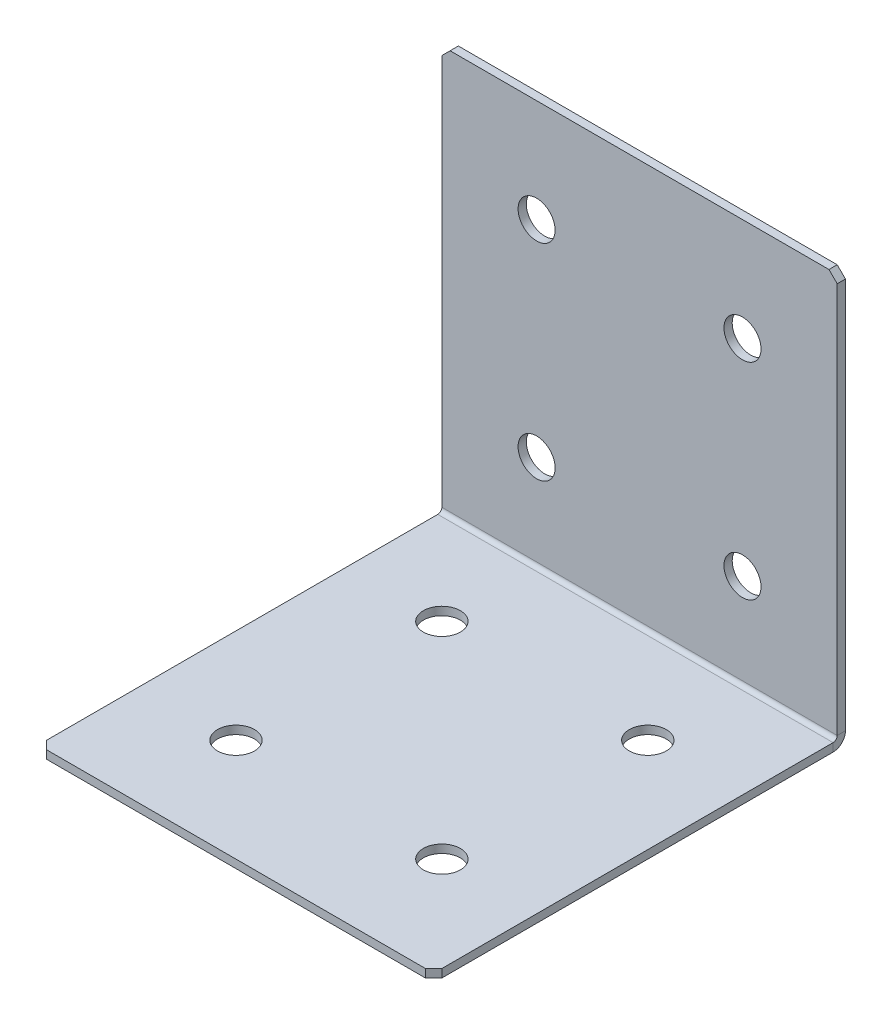
ISO-10303-21;
HEADER;
FILE_DESCRIPTION(('STEP AP214'),'2;1');
FILE_NAME('part.step','',(''),(''),'','','');
FILE_SCHEMA(('AUTOMOTIVE_DESIGN { 1 0 10303 214 1 1 1 1 }'));
ENDSEC;
DATA;
#1=APPLICATION_CONTEXT('core data for automotive mechanical design processes');
#2=APPLICATION_PROTOCOL_DEFINITION('international standard','automotive_design',2000,#1);
#3=PRODUCT_CONTEXT('',#1,'mechanical');
#4=PRODUCT('Part','Part','',(#3));
#5=PRODUCT_RELATED_PRODUCT_CATEGORY('part','',(#4));
#6=PRODUCT_DEFINITION_FORMATION('','',#4);
#7=PRODUCT_DEFINITION_CONTEXT('part definition',#1,'design');
#8=PRODUCT_DEFINITION('design','',#6,#7);
#9=PRODUCT_DEFINITION_SHAPE('','',#8);
#10=(LENGTH_UNIT() NAMED_UNIT(*) SI_UNIT(.MILLI.,.METRE.));
#11=(NAMED_UNIT(*) PLANE_ANGLE_UNIT() SI_UNIT($,.RADIAN.));
#12=(NAMED_UNIT(*) SI_UNIT($,.STERADIAN.) SOLID_ANGLE_UNIT());
#13=UNCERTAINTY_MEASURE_WITH_UNIT(LENGTH_MEASURE(1.E-05),#10,'distance_accuracy_value','');
#14=(GEOMETRIC_REPRESENTATION_CONTEXT(3) GLOBAL_UNCERTAINTY_ASSIGNED_CONTEXT((#13)) GLOBAL_UNIT_ASSIGNED_CONTEXT((#10,
#11,#12)) REPRESENTATION_CONTEXT('',''));
#15=CARTESIAN_POINT('',(0.,0.,0.));
#16=DIRECTION('',(0.,0.,1.));
#17=DIRECTION('',(1.,0.,0.));
#18=AXIS2_PLACEMENT_3D('',#15,#16,#17);
#19=CARTESIAN_POINT('',(0.,0.,2.));
#20=DIRECTION('',(0.,0.,-1.));
#21=DIRECTION('',(-1.,0.,0.));
#22=AXIS2_PLACEMENT_3D('',#19,#20,#21);
#23=PLANE('',#22);
#24=CARTESIAN_POINT('',(25.,24.9999999999996,2.));
#25=DIRECTION('',(0.,0.,1.));
#26=DIRECTION('',(1.,0.,0.));
#27=AXIS2_PLACEMENT_3D('',#24,#25,#26);
#28=CIRCLE('',#27,4.5);
#29=CARTESIAN_POINT('',(29.5,24.9999999999996,2.));
#30=VERTEX_POINT('',#29);
#31=EDGE_CURVE('E747',#30,#30,#28,.T.);
#32=ORIENTED_EDGE('',*,*,#31,.F.);
#33=EDGE_LOOP('',(#32));
#34=FACE_BOUND('',#33,.T.);
#35=CARTESIAN_POINT('',(25.,74.9999999999996,2.));
#36=DIRECTION('',(0.,0.,1.));
#37=DIRECTION('',(1.,0.,0.));
#38=AXIS2_PLACEMENT_3D('',#35,#36,#37);
#39=CIRCLE('',#38,4.5);
#40=CARTESIAN_POINT('',(29.5,74.9999999999996,2.));
#41=VERTEX_POINT('',#40);
#42=EDGE_CURVE('E763',#41,#41,#39,.T.);
#43=ORIENTED_EDGE('',*,*,#42,.F.);
#44=EDGE_LOOP('',(#43));
#45=FACE_BOUND('',#44,.T.);
#46=DIRECTION('',(0.,1.,0.));
#47=VECTOR('',#46,1.);
#48=CARTESIAN_POINT('',(48.,0.,2.));
#49=LINE('',#48,#47);
#50=CARTESIAN_POINT('',(48.,3.,2.));
#51=VERTEX_POINT('',#50);
#52=CARTESIAN_POINT('',(48.,98.,2.));
#53=VERTEX_POINT('',#52);
#54=EDGE_CURVE('E251',#51,#53,#49,.T.);
#55=ORIENTED_EDGE('',*,*,#54,.T.);
#56=DIRECTION('',(0.707106781186552,-0.707106781186543,0.));
#57=VECTOR('',#56,1.);
#58=CARTESIAN_POINT('',(48.,98.,2.));
#59=LINE('',#58,#57);
#60=CARTESIAN_POINT('',(46.,100.,2.));
#61=VERTEX_POINT('',#60);
#62=EDGE_CURVE('E276',#53,#61,#59,.F.);
#63=ORIENTED_EDGE('',*,*,#62,.T.);
#64=DIRECTION('',(-1.,0.,0.));
#65=VECTOR('',#64,1.);
#66=CARTESIAN_POINT('',(-48.,100.,2.));
#67=LINE('',#66,#65);
#68=CARTESIAN_POINT('',(-46.,100.,2.));
#69=VERTEX_POINT('',#68);
#70=EDGE_CURVE('E256',#61,#69,#67,.T.);
#71=ORIENTED_EDGE('',*,*,#70,.T.);
#72=DIRECTION('',(0.707106781186548,0.707106781186548,0.));
#73=VECTOR('',#72,1.);
#74=CARTESIAN_POINT('',(-46.,100.,2.));
#75=LINE('',#74,#73);
#76=CARTESIAN_POINT('',(-48.,98.,2.));
#77=VERTEX_POINT('',#76);
#78=EDGE_CURVE('E273',#69,#77,#75,.F.);
#79=ORIENTED_EDGE('',*,*,#78,.T.);
#80=DIRECTION('',(0.,-1.,0.));
#81=VECTOR('',#80,1.);
#82=CARTESIAN_POINT('',(-48.,0.,2.));
#83=LINE('',#82,#81);
#84=CARTESIAN_POINT('',(-48.,3.,2.));
#85=VERTEX_POINT('',#84);
#86=EDGE_CURVE('E248',#77,#85,#83,.T.);
#87=ORIENTED_EDGE('',*,*,#86,.T.);
#88=DIRECTION('',(1.,0.,0.));
#89=VECTOR('',#88,1.);
#90=CARTESIAN_POINT('',(48.,3.,2.));
#91=LINE('',#90,#89);
#92=EDGE_CURVE('E235',#51,#85,#91,.F.);
#93=ORIENTED_EDGE('',*,*,#92,.F.);
#94=EDGE_LOOP('',(#55,#63,#71,#79,#87,#93));
#95=FACE_BOUND('',#94,.T.);
#96=CARTESIAN_POINT('',(-25.,74.9999999999996,2.));
#97=DIRECTION('',(0.,0.,1.));
#98=DIRECTION('',(1.,0.,0.));
#99=AXIS2_PLACEMENT_3D('',#96,#97,#98);
#100=CIRCLE('',#99,4.5);
#101=CARTESIAN_POINT('',(-20.5,74.9999999999996,2.));
#102=VERTEX_POINT('',#101);
#103=EDGE_CURVE('E755',#102,#102,#100,.T.);
#104=ORIENTED_EDGE('',*,*,#103,.F.);
#105=EDGE_LOOP('',(#104));
#106=FACE_BOUND('',#105,.T.);
#107=CARTESIAN_POINT('',(-25.,24.9999999999996,2.));
#108=DIRECTION('',(0.,0.,1.));
#109=DIRECTION('',(1.,0.,0.));
#110=AXIS2_PLACEMENT_3D('',#107,#108,#109);
#111=CIRCLE('',#110,4.5);
#112=CARTESIAN_POINT('',(-20.5,24.9999999999996,2.));
#113=VERTEX_POINT('',#112);
#114=EDGE_CURVE('E730',#113,#113,#111,.T.);
#115=ORIENTED_EDGE('',*,*,#114,.F.);
#116=EDGE_LOOP('',(#115));
#117=FACE_BOUND('',#116,.T.);
#118=ADVANCED_FACE('F73',(#34,#45,#95,#106,#117),#23,.F.);
#119=CARTESIAN_POINT('',(48.,0.,2.));
#120=DIRECTION('',(-1.,0.,0.));
#121=DIRECTION('',(0.,1.,0.));
#122=AXIS2_PLACEMENT_3D('',#119,#120,#121);
#123=PLANE('',#122);
#124=DIRECTION('',(0.,1.,0.));
#125=VECTOR('',#124,1.);
#126=CARTESIAN_POINT('',(48.,0.,0.));
#127=LINE('',#126,#125);
#128=CARTESIAN_POINT('',(48.,3.,0.));
#129=VERTEX_POINT('',#128);
#130=CARTESIAN_POINT('',(48.,98.,0.));
#131=VERTEX_POINT('',#130);
#132=EDGE_CURVE('E263',#129,#131,#127,.T.);
#133=ORIENTED_EDGE('',*,*,#132,.T.);
#134=DIRECTION('',(0.,0.,-1.));
#135=VECTOR('',#134,1.);
#136=CARTESIAN_POINT('',(48.,98.,2.));
#137=LINE('',#136,#135);
#138=EDGE_CURVE('E260',#131,#53,#137,.F.);
#139=ORIENTED_EDGE('',*,*,#138,.T.);
#140=ORIENTED_EDGE('',*,*,#54,.F.);
#141=DIRECTION('',(0.,0.,-1.));
#142=VECTOR('',#141,1.);
#143=CARTESIAN_POINT('',(48.,3.,2.));
#144=LINE('',#143,#142);
#145=EDGE_CURVE('E230',#51,#129,#144,.T.);
#146=ORIENTED_EDGE('',*,*,#145,.T.);
#147=EDGE_LOOP('',(#133,#139,#140,#146));
#148=FACE_BOUND('',#147,.T.);
#149=ADVANCED_FACE('F363',(#148),#123,.F.);
#150=CARTESIAN_POINT('',(0.,0.,0.));
#151=DIRECTION('',(0.,0.,-1.));
#152=DIRECTION('',(-1.,0.,0.));
#153=AXIS2_PLACEMENT_3D('',#150,#151,#152);
#154=PLANE('',#153);
#155=CARTESIAN_POINT('',(-25.,24.9999999999996,0.));
#156=DIRECTION('',(0.,0.,-1.));
#157=DIRECTION('',(-1.,0.,0.));
#158=AXIS2_PLACEMENT_3D('',#155,#156,#157);
#159=CIRCLE('',#158,4.5);
#160=CARTESIAN_POINT('',(-29.5,24.9999999999996,0.));
#161=VERTEX_POINT('',#160);
#162=EDGE_CURVE('E738',#161,#161,#159,.T.);
#163=ORIENTED_EDGE('',*,*,#162,.F.);
#164=EDGE_LOOP('',(#163));
#165=FACE_BOUND('',#164,.T.);
#166=CARTESIAN_POINT('',(25.,24.9999999999996,0.));
#167=DIRECTION('',(0.,0.,-1.));
#168=DIRECTION('',(-1.,0.,0.));
#169=AXIS2_PLACEMENT_3D('',#166,#167,#168);
#170=CIRCLE('',#169,4.5);
#171=CARTESIAN_POINT('',(20.5,24.9999999999996,0.));
#172=VERTEX_POINT('',#171);
#173=EDGE_CURVE('E751',#172,#172,#170,.T.);
#174=ORIENTED_EDGE('',*,*,#173,.F.);
#175=EDGE_LOOP('',(#174));
#176=FACE_BOUND('',#175,.T.);
#177=CARTESIAN_POINT('',(-25.,74.9999999999996,0.));
#178=DIRECTION('',(0.,0.,-1.));
#179=DIRECTION('',(-1.,0.,0.));
#180=AXIS2_PLACEMENT_3D('',#177,#178,#179);
#181=CIRCLE('',#180,4.5);
#182=CARTESIAN_POINT('',(-29.5,74.9999999999996,0.));
#183=VERTEX_POINT('',#182);
#184=EDGE_CURVE('E759',#183,#183,#181,.T.);
#185=ORIENTED_EDGE('',*,*,#184,.F.);
#186=EDGE_LOOP('',(#185));
#187=FACE_BOUND('',#186,.T.);
#188=CARTESIAN_POINT('',(25.,74.9999999999996,0.));
#189=DIRECTION('',(0.,0.,-1.));
#190=DIRECTION('',(-1.,0.,0.));
#191=AXIS2_PLACEMENT_3D('',#188,#189,#190);
#192=CIRCLE('',#191,4.5);
#193=CARTESIAN_POINT('',(20.5,74.9999999999996,0.));
#194=VERTEX_POINT('',#193);
#195=EDGE_CURVE('E225',#194,#194,#192,.T.);
#196=ORIENTED_EDGE('',*,*,#195,.F.);
#197=EDGE_LOOP('',(#196));
#198=FACE_BOUND('',#197,.T.);
#199=DIRECTION('',(-1.,0.,0.));
#200=VECTOR('',#199,1.);
#201=CARTESIAN_POINT('',(0.,100.,0.));
#202=LINE('',#201,#200);
#203=CARTESIAN_POINT('',(46.,100.,0.));
#204=VERTEX_POINT('',#203);
#205=CARTESIAN_POINT('',(-46.,100.,0.));
#206=VERTEX_POINT('',#205);
#207=EDGE_CURVE('E252',#204,#206,#202,.T.);
#208=ORIENTED_EDGE('',*,*,#207,.F.);
#209=DIRECTION('',(-0.707106781186552,0.707106781186543,0.));
#210=VECTOR('',#209,1.);
#211=CARTESIAN_POINT('',(72.9999999999997,73.0000000000007,0.));
#212=LINE('',#211,#210);
#213=EDGE_CURVE('E289',#204,#131,#212,.F.);
#214=ORIENTED_EDGE('',*,*,#213,.T.);
#215=ORIENTED_EDGE('',*,*,#132,.F.);
#216=DIRECTION('',(1.,0.,0.));
#217=VECTOR('',#216,1.);
#218=CARTESIAN_POINT('',(48.,3.,0.));
#219=LINE('',#218,#217);
#220=CARTESIAN_POINT('',(-48.,3.00000000000001,0.));
#221=VERTEX_POINT('',#220);
#222=EDGE_CURVE('E175',#129,#221,#219,.F.);
#223=ORIENTED_EDGE('',*,*,#222,.T.);
#224=DIRECTION('',(0.,1.,0.));
#225=VECTOR('',#224,1.);
#226=CARTESIAN_POINT('',(-48.,0.,0.));
#227=LINE('',#226,#225);
#228=CARTESIAN_POINT('',(-48.,98.,0.));
#229=VERTEX_POINT('',#228);
#230=EDGE_CURVE('E245',#229,#221,#227,.F.);
#231=ORIENTED_EDGE('',*,*,#230,.F.);
#232=DIRECTION('',(-0.707106781186548,-0.707106781186548,0.));
#233=VECTOR('',#232,1.);
#234=CARTESIAN_POINT('',(-73.,73.,0.));
#235=LINE('',#234,#233);
#236=EDGE_CURVE('E286',#229,#206,#235,.F.);
#237=ORIENTED_EDGE('',*,*,#236,.T.);
#238=EDGE_LOOP('',(#208,#214,#215,#223,#231,#237));
#239=FACE_BOUND('',#238,.T.);
#240=ADVANCED_FACE('F346',(#165,#176,#187,#198,#239),#154,.T.);
#241=CARTESIAN_POINT('',(-48.,100.,2.));
#242=DIRECTION('',(0.,-1.,0.));
#243=DIRECTION('',(-1.,0.,0.));
#244=AXIS2_PLACEMENT_3D('',#241,#242,#243);
#245=PLANE('',#244);
#246=ORIENTED_EDGE('',*,*,#70,.F.);
#247=DIRECTION('',(0.,0.,1.));
#248=VECTOR('',#247,1.);
#249=CARTESIAN_POINT('',(46.,100.,2.));
#250=LINE('',#249,#248);
#251=EDGE_CURVE('E283',#61,#204,#250,.F.);
#252=ORIENTED_EDGE('',*,*,#251,.T.);
#253=ORIENTED_EDGE('',*,*,#207,.T.);
#254=DIRECTION('',(0.,0.,-1.));
#255=VECTOR('',#254,1.);
#256=CARTESIAN_POINT('',(-46.,100.,2.));
#257=LINE('',#256,#255);
#258=EDGE_CURVE('E279',#206,#69,#257,.F.);
#259=ORIENTED_EDGE('',*,*,#258,.T.);
#260=EDGE_LOOP('',(#246,#252,#253,#259));
#261=FACE_BOUND('',#260,.T.);
#262=ADVANCED_FACE('F353',(#261),#245,.F.);
#263=CARTESIAN_POINT('',(-48.,0.,2.));
#264=DIRECTION('',(1.,0.,0.));
#265=DIRECTION('',(0.,-1.,0.));
#266=AXIS2_PLACEMENT_3D('',#263,#264,#265);
#267=PLANE('',#266);
#268=ORIENTED_EDGE('',*,*,#86,.F.);
#269=DIRECTION('',(0.,0.,1.));
#270=VECTOR('',#269,1.);
#271=CARTESIAN_POINT('',(-48.,98.,2.));
#272=LINE('',#271,#270);
#273=EDGE_CURVE('E292',#77,#229,#272,.F.);
#274=ORIENTED_EDGE('',*,*,#273,.T.);
#275=ORIENTED_EDGE('',*,*,#230,.T.);
#276=DIRECTION('',(0.,0.,-1.));
#277=VECTOR('',#276,1.);
#278=CARTESIAN_POINT('',(-48.,3.,2.));
#279=LINE('',#278,#277);
#280=EDGE_CURVE('E241',#85,#221,#279,.T.);
#281=ORIENTED_EDGE('',*,*,#280,.F.);
#282=EDGE_LOOP('',(#268,#274,#275,#281));
#283=FACE_BOUND('',#282,.T.);
#284=ADVANCED_FACE('F340',(#283),#267,.F.);
#285=CARTESIAN_POINT('',(-48.,3.,3.));
#286=DIRECTION('',(-1.,0.,0.));
#287=DIRECTION('',(0.,0.,1.));
#288=AXIS2_PLACEMENT_3D('',#285,#286,#287);
#289=PLANE('',#288);
#290=DIRECTION('',(0.,1.,0.));
#291=VECTOR('',#290,1.);
#292=CARTESIAN_POINT('',(-48.,0.,2.99999999999999));
#293=LINE('',#292,#291);
#294=CARTESIAN_POINT('',(-48.,2.,3.));
#295=VERTEX_POINT('',#294);
#296=CARTESIAN_POINT('',(-48.,0.,2.99999999999999));
#297=VERTEX_POINT('',#296);
#298=EDGE_CURVE('E221',#295,#297,#293,.F.);
#299=ORIENTED_EDGE('',*,*,#298,.F.);
#300=CARTESIAN_POINT('',(-48.,3.,3.));
#301=DIRECTION('',(1.,0.,0.));
#302=DIRECTION('',(0.,0.,-1.));
#303=AXIS2_PLACEMENT_3D('',#300,#301,#302);
#304=CIRCLE('',#303,1.);
#305=EDGE_CURVE('E179',#85,#295,#304,.F.);
#306=ORIENTED_EDGE('',*,*,#305,.F.);
#307=ORIENTED_EDGE('',*,*,#280,.T.);
#308=CARTESIAN_POINT('',(-48.,3.,3.));
#309=DIRECTION('',(1.,0.,0.));
#310=DIRECTION('',(0.,0.,-1.));
#311=AXIS2_PLACEMENT_3D('',#308,#309,#310);
#312=CIRCLE('',#311,3.);
#313=EDGE_CURVE('E228',#221,#297,#312,.F.);
#314=ORIENTED_EDGE('',*,*,#313,.T.);
#315=EDGE_LOOP('',(#299,#306,#307,#314));
#316=FACE_BOUND('',#315,.T.);
#317=ADVANCED_FACE('F337',(#316),#289,.T.);
#318=CARTESIAN_POINT('',(48.,3.,3.));
#319=DIRECTION('',(-1.,0.,0.));
#320=DIRECTION('',(0.,0.,1.));
#321=AXIS2_PLACEMENT_3D('',#318,#319,#320);
#322=PLANE('',#321);
#323=CARTESIAN_POINT('',(48.,3.,3.));
#324=DIRECTION('',(1.,0.,0.));
#325=DIRECTION('',(0.,0.,-1.));
#326=AXIS2_PLACEMENT_3D('',#323,#324,#325);
#327=CIRCLE('',#326,1.);
#328=CARTESIAN_POINT('',(48.,2.,3.));
#329=VERTEX_POINT('',#328);
#330=EDGE_CURVE('E186',#329,#51,#327,.T.);
#331=ORIENTED_EDGE('',*,*,#330,.F.);
#332=DIRECTION('',(0.,1.,0.));
#333=VECTOR('',#332,1.);
#334=CARTESIAN_POINT('',(48.,2.,3.));
#335=LINE('',#334,#333);
#336=CARTESIAN_POINT('',(48.,0.,2.99999999999999));
#337=VERTEX_POINT('',#336);
#338=EDGE_CURVE('E183',#329,#337,#335,.F.);
#339=ORIENTED_EDGE('',*,*,#338,.T.);
#340=CARTESIAN_POINT('',(48.,3.,3.));
#341=DIRECTION('',(1.,0.,0.));
#342=DIRECTION('',(0.,0.,-1.));
#343=AXIS2_PLACEMENT_3D('',#340,#341,#342);
#344=CIRCLE('',#343,3.);
#345=EDGE_CURVE('E167',#337,#129,#344,.T.);
#346=ORIENTED_EDGE('',*,*,#345,.T.);
#347=ORIENTED_EDGE('',*,*,#145,.F.);
#348=EDGE_LOOP('',(#331,#339,#346,#347));
#349=FACE_BOUND('',#348,.T.);
#350=ADVANCED_FACE('F184',(#349),#322,.F.);
#351=CARTESIAN_POINT('',(48.,3.,3.));
#352=DIRECTION('',(1.,0.,0.));
#353=DIRECTION('',(0.,-1.,0.));
#354=AXIS2_PLACEMENT_3D('',#351,#352,#353);
#355=CYLINDRICAL_SURFACE('',#354,3.);
#356=ORIENTED_EDGE('',*,*,#222,.F.);
#357=ORIENTED_EDGE('',*,*,#345,.F.);
#358=DIRECTION('',(1.,0.,0.));
#359=VECTOR('',#358,1.);
#360=CARTESIAN_POINT('',(-48.,0.,2.99999999999999));
#361=LINE('',#360,#359);
#362=EDGE_CURVE('E172',#337,#297,#361,.F.);
#363=ORIENTED_EDGE('',*,*,#362,.T.);
#364=ORIENTED_EDGE('',*,*,#313,.F.);
#365=EDGE_LOOP('',(#356,#357,#363,#364));
#366=FACE_BOUND('',#365,.T.);
#367=ADVANCED_FACE('F169',(#366),#355,.T.);
#368=CARTESIAN_POINT('',(48.,3.,3.));
#369=DIRECTION('',(1.,0.,0.));
#370=DIRECTION('',(0.,-1.,0.));
#371=AXIS2_PLACEMENT_3D('',#368,#369,#370);
#372=CYLINDRICAL_SURFACE('',#371,1.);
#373=ORIENTED_EDGE('',*,*,#92,.T.);
#374=ORIENTED_EDGE('',*,*,#305,.T.);
#375=DIRECTION('',(1.,0.,0.));
#376=VECTOR('',#375,1.);
#377=CARTESIAN_POINT('',(-48.,2.,3.));
#378=LINE('',#377,#376);
#379=EDGE_CURVE('E189',#295,#329,#378,.T.);
#380=ORIENTED_EDGE('',*,*,#379,.T.);
#381=ORIENTED_EDGE('',*,*,#330,.T.);
#382=EDGE_LOOP('',(#373,#374,#380,#381));
#383=FACE_BOUND('',#382,.T.);
#384=ADVANCED_FACE('F332',(#383),#372,.F.);
#385=CARTESIAN_POINT('',(-48.,0.,1.99999999999999));
#386=DIRECTION('',(1.,0.,0.));
#387=DIRECTION('',(0.,0.,-1.));
#388=AXIS2_PLACEMENT_3D('',#385,#386,#387);
#389=PLANE('',#388);
#390=DIRECTION('',(0.,0.,-1.));
#391=VECTOR('',#390,1.);
#392=CARTESIAN_POINT('',(-48.,0.,0.));
#393=LINE('',#392,#391);
#394=CARTESIAN_POINT('',(-48.,-3.3522627730272E-13,98.));
#395=VERTEX_POINT('',#394);
#396=EDGE_CURVE('E194',#395,#297,#393,.T.);
#397=ORIENTED_EDGE('',*,*,#396,.F.);
#398=DIRECTION('',(0.,1.,0.));
#399=VECTOR('',#398,1.);
#400=CARTESIAN_POINT('',(-48.,-3.35182208528941E-13,98.));
#401=LINE('',#400,#399);
#402=CARTESIAN_POINT('',(-48.,1.99999999999966,98.));
#403=VERTEX_POINT('',#402);
#404=EDGE_CURVE('E13',#395,#403,#401,.T.);
#405=ORIENTED_EDGE('',*,*,#404,.T.);
#406=DIRECTION('',(0.,0.,1.));
#407=VECTOR('',#406,1.);
#408=CARTESIAN_POINT('',(-48.,2.,2.));
#409=LINE('',#408,#407);
#410=EDGE_CURVE('E196',#403,#295,#409,.F.);
#411=ORIENTED_EDGE('',*,*,#410,.T.);
#412=ORIENTED_EDGE('',*,*,#298,.T.);
#413=EDGE_LOOP('',(#397,#405,#411,#412));
#414=FACE_BOUND('',#413,.T.);
#415=ADVANCED_FACE('F329',(#414),#389,.F.);
#416=CARTESIAN_POINT('',(48.,-3.42174205636425E-13,100.));
#417=DIRECTION('',(-1.,0.,0.));
#418=DIRECTION('',(0.,0.,1.));
#419=AXIS2_PLACEMENT_3D('',#416,#417,#418);
#420=PLANE('',#419);
#421=DIRECTION('',(0.,0.,-1.));
#422=VECTOR('',#421,1.);
#423=CARTESIAN_POINT('',(48.,1.99999999999966,100.));
#424=LINE('',#423,#422);
#425=CARTESIAN_POINT('',(48.,1.99999999999966,98.));
#426=VERTEX_POINT('',#425);
#427=EDGE_CURVE('E214',#329,#426,#424,.F.);
#428=ORIENTED_EDGE('',*,*,#427,.T.);
#429=DIRECTION('',(0.,-1.,0.));
#430=VECTOR('',#429,1.);
#431=CARTESIAN_POINT('',(48.,-3.35191242958739E-13,98.));
#432=LINE('',#431,#430);
#433=CARTESIAN_POINT('',(48.,-3.3522627730272E-13,98.));
#434=VERTEX_POINT('',#433);
#435=EDGE_CURVE('E98',#426,#434,#432,.T.);
#436=ORIENTED_EDGE('',*,*,#435,.T.);
#437=DIRECTION('',(0.,0.,1.));
#438=VECTOR('',#437,1.);
#439=CARTESIAN_POINT('',(48.,0.,0.));
#440=LINE('',#439,#438);
#441=EDGE_CURVE('E192',#337,#434,#440,.T.);
#442=ORIENTED_EDGE('',*,*,#441,.F.);
#443=ORIENTED_EDGE('',*,*,#338,.F.);
#444=EDGE_LOOP('',(#428,#436,#442,#443));
#445=FACE_BOUND('',#444,.T.);
#446=ADVANCED_FACE('F198',(#445),#420,.F.);
#447=CARTESIAN_POINT('',(0.,0.,0.));
#448=DIRECTION('',(0.,1.,0.));
#449=DIRECTION('',(0.,0.,1.));
#450=AXIS2_PLACEMENT_3D('',#447,#448,#449);
#451=PLANE('',#450);
#452=CARTESIAN_POINT('',(-25.,0.,24.9999999999997));
#453=DIRECTION('',(0.,1.,0.));
#454=DIRECTION('',(0.,0.,1.));
#455=AXIS2_PLACEMENT_3D('',#452,#453,#454);
#456=CIRCLE('',#455,4.5);
#457=CARTESIAN_POINT('',(-25.,0.,29.4999999999997));
#458=VERTEX_POINT('',#457);
#459=EDGE_CURVE('E717',#458,#458,#456,.T.);
#460=ORIENTED_EDGE('',*,*,#459,.T.);
#461=EDGE_LOOP('',(#460));
#462=FACE_BOUND('',#461,.T.);
#463=CARTESIAN_POINT('',(25.,0.,24.9999999999997));
#464=DIRECTION('',(0.,1.,0.));
#465=DIRECTION('',(0.,0.,1.));
#466=AXIS2_PLACEMENT_3D('',#463,#464,#465);
#467=CIRCLE('',#466,4.5);
#468=CARTESIAN_POINT('',(25.,0.,29.4999999999997));
#469=VERTEX_POINT('',#468);
#470=EDGE_CURVE('E721',#469,#469,#467,.T.);
#471=ORIENTED_EDGE('',*,*,#470,.T.);
#472=EDGE_LOOP('',(#471));
#473=FACE_BOUND('',#472,.T.);
#474=CARTESIAN_POINT('',(25.,-2.55004350968591E-13,74.9999999999996));
#475=DIRECTION('',(0.,1.,0.));
#476=DIRECTION('',(0.,0.,1.));
#477=AXIS2_PLACEMENT_3D('',#474,#475,#476);
#478=CIRCLE('',#477,4.5);
#479=CARTESIAN_POINT('',(25.,-2.70716016993385E-13,79.4999999999997));
#480=VERTEX_POINT('',#479);
#481=EDGE_CURVE('E725',#480,#480,#478,.T.);
#482=ORIENTED_EDGE('',*,*,#481,.T.);
#483=EDGE_LOOP('',(#482));
#484=FACE_BOUND('',#483,.T.);
#485=CARTESIAN_POINT('',(-25.,-2.55004350968591E-13,74.9999999999996));
#486=DIRECTION('',(0.,1.,0.));
#487=DIRECTION('',(0.,0.,1.));
#488=AXIS2_PLACEMENT_3D('',#485,#486,#487);
#489=CIRCLE('',#488,4.5);
#490=CARTESIAN_POINT('',(-25.,-2.70716016993385E-13,79.4999999999997));
#491=VERTEX_POINT('',#490);
#492=EDGE_CURVE('E728',#491,#491,#489,.T.);
#493=ORIENTED_EDGE('',*,*,#492,.T.);
#494=EDGE_LOOP('',(#493));
#495=FACE_BOUND('',#494,.T.);
#496=ORIENTED_EDGE('',*,*,#441,.T.);
#497=DIRECTION('',(0.707106781186548,0.,-0.707106781186548));
#498=VECTOR('',#497,1.);
#499=CARTESIAN_POINT('',(46.,-3.42174205636425E-13,100.));
#500=LINE('',#499,#498);
#501=CARTESIAN_POINT('',(46.,-3.42209239980406E-13,100.));
#502=VERTEX_POINT('',#501);
#503=EDGE_CURVE('E83',#434,#502,#500,.F.);
#504=ORIENTED_EDGE('',*,*,#503,.T.);
#505=DIRECTION('',(-1.,0.,0.));
#506=VECTOR('',#505,1.);
#507=CARTESIAN_POINT('',(0.,-3.42209239980406E-13,100.));
#508=LINE('',#507,#506);
#509=CARTESIAN_POINT('',(-46.,-3.42209239980406E-13,100.));
#510=VERTEX_POINT('',#509);
#511=EDGE_CURVE('E200',#502,#510,#508,.T.);
#512=ORIENTED_EDGE('',*,*,#511,.T.);
#513=DIRECTION('',(0.707106781186552,0.,0.707106781186543));
#514=VECTOR('',#513,1.);
#515=CARTESIAN_POINT('',(-48.,-3.35182208528941E-13,98.));
#516=LINE('',#515,#514);
#517=EDGE_CURVE('E90',#510,#395,#516,.F.);
#518=ORIENTED_EDGE('',*,*,#517,.T.);
#519=ORIENTED_EDGE('',*,*,#396,.T.);
#520=ORIENTED_EDGE('',*,*,#362,.F.);
#521=EDGE_LOOP('',(#496,#504,#512,#518,#519,#520));
#522=FACE_BOUND('',#521,.T.);
#523=ADVANCED_FACE('F191',(#462,#473,#484,#495,#522),#451,.F.);
#524=CARTESIAN_POINT('',(0.,2.00000000000001,0.));
#525=DIRECTION('',(0.,1.,0.));
#526=DIRECTION('',(0.,0.,1.));
#527=AXIS2_PLACEMENT_3D('',#524,#525,#526);
#528=PLANE('',#527);
#529=CARTESIAN_POINT('',(-25.,1.99999999999992,24.9999999999997));
#530=DIRECTION('',(0.,1.,0.));
#531=DIRECTION('',(0.,0.,1.));
#532=AXIS2_PLACEMENT_3D('',#529,#530,#531);
#533=CIRCLE('',#532,4.5);
#534=CARTESIAN_POINT('',(-25.,1.9999999999999,29.4999999999997));
#535=VERTEX_POINT('',#534);
#536=EDGE_CURVE('E941',#535,#535,#533,.T.);
#537=ORIENTED_EDGE('',*,*,#536,.F.);
#538=EDGE_LOOP('',(#537));
#539=FACE_BOUND('',#538,.T.);
#540=CARTESIAN_POINT('',(25.,1.99999999999992,24.9999999999997));
#541=DIRECTION('',(0.,1.,0.));
#542=DIRECTION('',(0.,0.,1.));
#543=AXIS2_PLACEMENT_3D('',#540,#541,#542);
#544=CIRCLE('',#543,4.5);
#545=CARTESIAN_POINT('',(25.,1.9999999999999,29.4999999999997));
#546=VERTEX_POINT('',#545);
#547=EDGE_CURVE('E869',#546,#546,#544,.T.);
#548=ORIENTED_EDGE('',*,*,#547,.F.);
#549=EDGE_LOOP('',(#548));
#550=FACE_BOUND('',#549,.T.);
#551=CARTESIAN_POINT('',(25.,1.99999999999975,74.9999999999997));
#552=DIRECTION('',(0.,1.,0.));
#553=DIRECTION('',(0.,0.,1.));
#554=AXIS2_PLACEMENT_3D('',#551,#552,#553);
#555=CIRCLE('',#554,4.5);
#556=CARTESIAN_POINT('',(25.,1.99999999999973,79.4999999999997));
#557=VERTEX_POINT('',#556);
#558=EDGE_CURVE('E859',#557,#557,#555,.T.);
#559=ORIENTED_EDGE('',*,*,#558,.F.);
#560=EDGE_LOOP('',(#559));
#561=FACE_BOUND('',#560,.T.);
#562=CARTESIAN_POINT('',(-25.,1.99999999999975,74.9999999999997));
#563=DIRECTION('',(0.,1.,0.));
#564=DIRECTION('',(0.,0.,1.));
#565=AXIS2_PLACEMENT_3D('',#562,#563,#564);
#566=CIRCLE('',#565,4.5);
#567=CARTESIAN_POINT('',(-25.,1.99999999999973,79.4999999999997));
#568=VERTEX_POINT('',#567);
#569=EDGE_CURVE('E731',#568,#568,#566,.T.);
#570=ORIENTED_EDGE('',*,*,#569,.F.);
#571=EDGE_LOOP('',(#570));
#572=FACE_BOUND('',#571,.T.);
#573=DIRECTION('',(1.,0.,0.));
#574=VECTOR('',#573,1.);
#575=CARTESIAN_POINT('',(-48.,1.99999999999966,100.));
#576=LINE('',#575,#574);
#577=CARTESIAN_POINT('',(46.,1.99999999999966,100.));
#578=VERTEX_POINT('',#577);
#579=CARTESIAN_POINT('',(-46.,1.99999999999966,100.));
#580=VERTEX_POINT('',#579);
#581=EDGE_CURVE('E207',#578,#580,#576,.F.);
#582=ORIENTED_EDGE('',*,*,#581,.F.);
#583=DIRECTION('',(-0.707106781186548,0.,0.707106781186548));
#584=VECTOR('',#583,1.);
#585=CARTESIAN_POINT('',(73.,1.99999999999975,73.));
#586=LINE('',#585,#584);
#587=EDGE_CURVE('E305',#578,#426,#586,.F.);
#588=ORIENTED_EDGE('',*,*,#587,.T.);
#589=ORIENTED_EDGE('',*,*,#427,.F.);
#590=ORIENTED_EDGE('',*,*,#379,.F.);
#591=ORIENTED_EDGE('',*,*,#410,.F.);
#592=DIRECTION('',(-0.707106781186552,0.,-0.707106781186543));
#593=VECTOR('',#592,1.);
#594=CARTESIAN_POINT('',(-72.9999999999997,1.99999999999975,73.0000000000007));
#595=LINE('',#594,#593);
#596=EDGE_CURVE('E302',#403,#580,#595,.F.);
#597=ORIENTED_EDGE('',*,*,#596,.T.);
#598=EDGE_LOOP('',(#582,#588,#589,#590,#591,#597));
#599=FACE_BOUND('',#598,.T.);
#600=ADVANCED_FACE('F323',(#539,#550,#561,#572,#599),#528,.T.);
#601=CARTESIAN_POINT('',(-48.,-3.42174205636425E-13,100.));
#602=DIRECTION('',(0.,0.,-1.));
#603=DIRECTION('',(0.,1.,0.));
#604=AXIS2_PLACEMENT_3D('',#601,#602,#603);
#605=PLANE('',#604);
#606=ORIENTED_EDGE('',*,*,#511,.F.);
#607=DIRECTION('',(0.,1.,0.));
#608=VECTOR('',#607,1.);
#609=CARTESIAN_POINT('',(46.,-3.42174205636425E-13,100.));
#610=LINE('',#609,#608);
#611=EDGE_CURVE('E298',#502,#578,#610,.T.);
#612=ORIENTED_EDGE('',*,*,#611,.T.);
#613=ORIENTED_EDGE('',*,*,#581,.T.);
#614=DIRECTION('',(0.,-1.,0.));
#615=VECTOR('',#614,1.);
#616=CARTESIAN_POINT('',(-46.,-3.42174205636425E-13,100.));
#617=LINE('',#616,#615);
#618=EDGE_CURVE('E295',#580,#510,#617,.T.);
#619=ORIENTED_EDGE('',*,*,#618,.T.);
#620=EDGE_LOOP('',(#606,#612,#613,#619));
#621=FACE_BOUND('',#620,.T.);
#622=ADVANCED_FACE('F318',(#621),#605,.F.);
#623=CARTESIAN_POINT('',(25.,74.9999999999996,2.));
#624=DIRECTION('',(0.,0.,1.));
#625=DIRECTION('',(1.,0.,0.));
#626=AXIS2_PLACEMENT_3D('',#623,#624,#625);
#627=CYLINDRICAL_SURFACE('',#626,4.5);
#628=ORIENTED_EDGE('',*,*,#42,.T.);
#629=EDGE_LOOP('',(#628));
#630=FACE_BOUND('',#629,.T.);
#631=ORIENTED_EDGE('',*,*,#195,.T.);
#632=EDGE_LOOP('',(#631));
#633=FACE_BOUND('',#632,.T.);
#634=ADVANCED_FACE('F471',(#630,#633),#627,.F.);
#635=CARTESIAN_POINT('',(-25.,74.9999999999996,2.));
#636=DIRECTION('',(0.,0.,1.));
#637=DIRECTION('',(1.,0.,0.));
#638=AXIS2_PLACEMENT_3D('',#635,#636,#637);
#639=CYLINDRICAL_SURFACE('',#638,4.5);
#640=ORIENTED_EDGE('',*,*,#103,.T.);
#641=EDGE_LOOP('',(#640));
#642=FACE_BOUND('',#641,.T.);
#643=ORIENTED_EDGE('',*,*,#184,.T.);
#644=EDGE_LOOP('',(#643));
#645=FACE_BOUND('',#644,.T.);
#646=ADVANCED_FACE('F462',(#642,#645),#639,.F.);
#647=CARTESIAN_POINT('',(25.,24.9999999999996,2.));
#648=DIRECTION('',(0.,0.,1.));
#649=DIRECTION('',(1.,0.,0.));
#650=AXIS2_PLACEMENT_3D('',#647,#648,#649);
#651=CYLINDRICAL_SURFACE('',#650,4.5);
#652=ORIENTED_EDGE('',*,*,#31,.T.);
#653=EDGE_LOOP('',(#652));
#654=FACE_BOUND('',#653,.T.);
#655=ORIENTED_EDGE('',*,*,#173,.T.);
#656=EDGE_LOOP('',(#655));
#657=FACE_BOUND('',#656,.T.);
#658=ADVANCED_FACE('F453',(#654,#657),#651,.F.);
#659=CARTESIAN_POINT('',(-25.,24.9999999999996,2.));
#660=DIRECTION('',(0.,0.,1.));
#661=DIRECTION('',(1.,0.,0.));
#662=AXIS2_PLACEMENT_3D('',#659,#660,#661);
#663=CYLINDRICAL_SURFACE('',#662,4.5);
#664=ORIENTED_EDGE('',*,*,#114,.T.);
#665=EDGE_LOOP('',(#664));
#666=FACE_BOUND('',#665,.T.);
#667=ORIENTED_EDGE('',*,*,#162,.T.);
#668=EDGE_LOOP('',(#667));
#669=FACE_BOUND('',#668,.T.);
#670=ADVANCED_FACE('F444',(#666,#669),#663,.F.);
#671=CARTESIAN_POINT('',(-25.,1.99999999999975,74.9999999999997));
#672=DIRECTION('',(0.,1.,0.));
#673=DIRECTION('',(0.,0.,1.));
#674=AXIS2_PLACEMENT_3D('',#671,#672,#673);
#675=CYLINDRICAL_SURFACE('',#674,4.5);
#676=ORIENTED_EDGE('',*,*,#492,.F.);
#677=EDGE_LOOP('',(#676));
#678=FACE_BOUND('',#677,.T.);
#679=ORIENTED_EDGE('',*,*,#569,.T.);
#680=EDGE_LOOP('',(#679));
#681=FACE_BOUND('',#680,.T.);
#682=ADVANCED_FACE('F435',(#678,#681),#675,.F.);
#683=CARTESIAN_POINT('',(25.,1.99999999999975,74.9999999999997));
#684=DIRECTION('',(0.,1.,0.));
#685=DIRECTION('',(0.,0.,1.));
#686=AXIS2_PLACEMENT_3D('',#683,#684,#685);
#687=CYLINDRICAL_SURFACE('',#686,4.5);
#688=ORIENTED_EDGE('',*,*,#481,.F.);
#689=EDGE_LOOP('',(#688));
#690=FACE_BOUND('',#689,.T.);
#691=ORIENTED_EDGE('',*,*,#558,.T.);
#692=EDGE_LOOP('',(#691));
#693=FACE_BOUND('',#692,.T.);
#694=ADVANCED_FACE('F426',(#690,#693),#687,.F.);
#695=CARTESIAN_POINT('',(25.,1.99999999999992,24.9999999999997));
#696=DIRECTION('',(0.,1.,0.));
#697=DIRECTION('',(0.,0.,1.));
#698=AXIS2_PLACEMENT_3D('',#695,#696,#697);
#699=CYLINDRICAL_SURFACE('',#698,4.5);
#700=ORIENTED_EDGE('',*,*,#470,.F.);
#701=EDGE_LOOP('',(#700));
#702=FACE_BOUND('',#701,.T.);
#703=ORIENTED_EDGE('',*,*,#547,.T.);
#704=EDGE_LOOP('',(#703));
#705=FACE_BOUND('',#704,.T.);
#706=ADVANCED_FACE('F417',(#702,#705),#699,.F.);
#707=CARTESIAN_POINT('',(-25.,1.99999999999992,24.9999999999997));
#708=DIRECTION('',(0.,1.,0.));
#709=DIRECTION('',(0.,0.,1.));
#710=AXIS2_PLACEMENT_3D('',#707,#708,#709);
#711=CYLINDRICAL_SURFACE('',#710,4.5);
#712=ORIENTED_EDGE('',*,*,#459,.F.);
#713=EDGE_LOOP('',(#712));
#714=FACE_BOUND('',#713,.T.);
#715=ORIENTED_EDGE('',*,*,#536,.T.);
#716=EDGE_LOOP('',(#715));
#717=FACE_BOUND('',#716,.T.);
#718=ADVANCED_FACE('F383',(#714,#717),#711,.F.);
#719=CARTESIAN_POINT('',(48.,98.,2.));
#720=DIRECTION('',(-0.707106781186543,-0.707106781186552,0.));
#721=DIRECTION('',(0.,0.,1.));
#722=AXIS2_PLACEMENT_3D('',#719,#720,#721);
#723=PLANE('',#722);
#724=ORIENTED_EDGE('',*,*,#213,.F.);
#725=ORIENTED_EDGE('',*,*,#251,.F.);
#726=ORIENTED_EDGE('',*,*,#62,.F.);
#727=ORIENTED_EDGE('',*,*,#138,.F.);
#728=EDGE_LOOP('',(#724,#725,#726,#727));
#729=FACE_BOUND('',#728,.T.);
#730=ADVANCED_FACE('F361',(#729),#723,.F.);
#731=CARTESIAN_POINT('',(-46.,100.,2.));
#732=DIRECTION('',(0.707106781186547,-0.707106781186547,0.));
#733=DIRECTION('',(0.,0.,1.));
#734=AXIS2_PLACEMENT_3D('',#731,#732,#733);
#735=PLANE('',#734);
#736=ORIENTED_EDGE('',*,*,#236,.F.);
#737=ORIENTED_EDGE('',*,*,#273,.F.);
#738=ORIENTED_EDGE('',*,*,#78,.F.);
#739=ORIENTED_EDGE('',*,*,#258,.F.);
#740=EDGE_LOOP('',(#736,#737,#738,#739));
#741=FACE_BOUND('',#740,.T.);
#742=ADVANCED_FACE('F350',(#741),#735,.F.);
#743=CARTESIAN_POINT('',(46.,-3.42174205636425E-13,100.));
#744=DIRECTION('',(-0.707106781186547,0.,-0.707106781186547));
#745=DIRECTION('',(0.,1.,0.));
#746=AXIS2_PLACEMENT_3D('',#743,#744,#745);
#747=PLANE('',#746);
#748=ORIENTED_EDGE('',*,*,#503,.F.);
#749=ORIENTED_EDGE('',*,*,#435,.F.);
#750=ORIENTED_EDGE('',*,*,#587,.F.);
#751=ORIENTED_EDGE('',*,*,#611,.F.);
#752=EDGE_LOOP('',(#748,#749,#750,#751));
#753=FACE_BOUND('',#752,.T.);
#754=ADVANCED_FACE('F321',(#753),#747,.F.);
#755=CARTESIAN_POINT('',(-48.,-3.35182208528941E-13,98.));
#756=DIRECTION('',(0.707106781186542,0.,-0.707106781186552));
#757=DIRECTION('',(0.,1.,0.));
#758=AXIS2_PLACEMENT_3D('',#755,#756,#757);
#759=PLANE('',#758);
#760=ORIENTED_EDGE('',*,*,#517,.F.);
#761=ORIENTED_EDGE('',*,*,#618,.F.);
#762=ORIENTED_EDGE('',*,*,#596,.F.);
#763=ORIENTED_EDGE('',*,*,#404,.F.);
#764=EDGE_LOOP('',(#760,#761,#762,#763));
#765=FACE_BOUND('',#764,.T.);
#766=ADVANCED_FACE('F76',(#765),#759,.F.);
#767=CLOSED_SHELL('',(#118,#149,#240,#262,#284,#317,#350,#367,#384,#415,#446,#523,#600,#622,
#634,#646,#658,#670,#682,#694,#706,#718,#730,#742,#754,#766));
#768=MANIFOLD_SOLID_BREP('B2',#767);
#769=ADVANCED_BREP_SHAPE_REPRESENTATION('',(#18,#768),#14);
#770=SHAPE_DEFINITION_REPRESENTATION(#9,#769);
ENDSEC;
END-ISO-10303-21;
